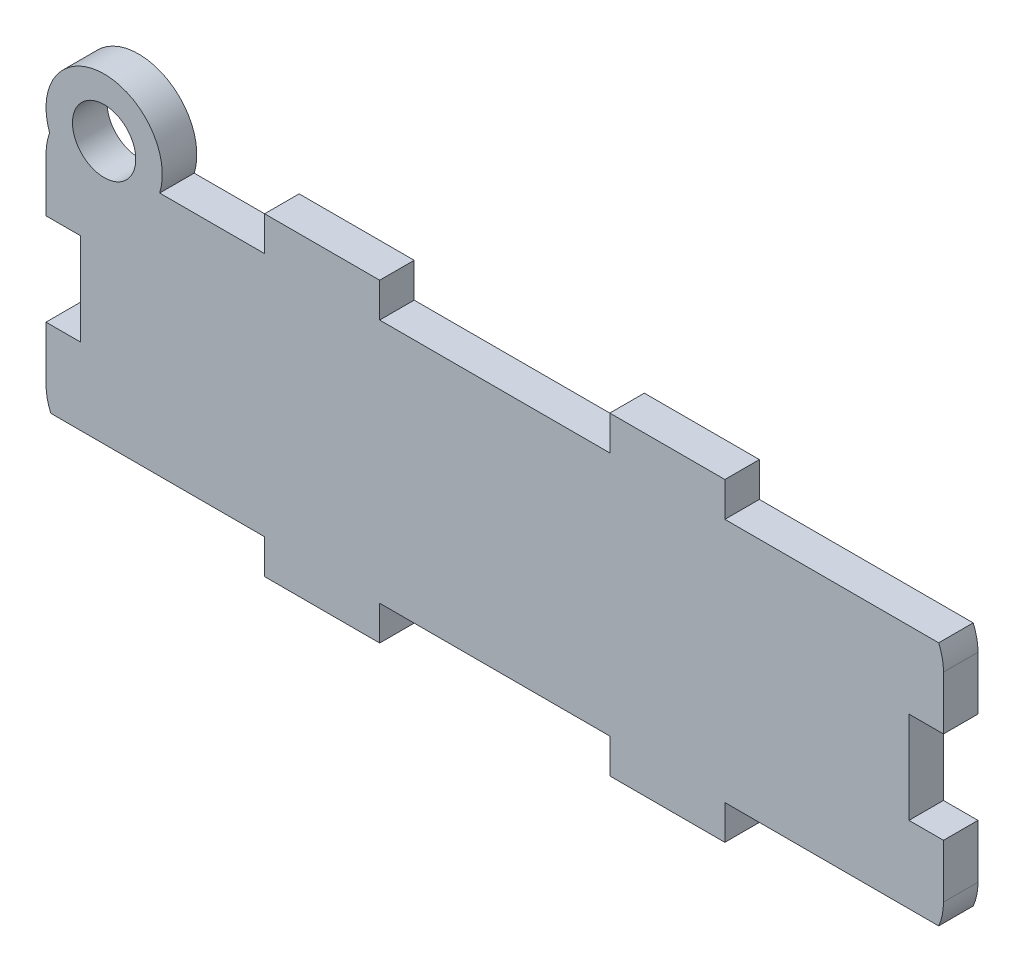
ISO-10303-21;
HEADER;
FILE_DESCRIPTION(('STEP AP214'),'2;1');
FILE_NAME('part.step','',(''),(''),'','','');
FILE_SCHEMA(('AUTOMOTIVE_DESIGN { 1 0 10303 214 1 1 1 1 }'));
ENDSEC;
DATA;
#1=APPLICATION_CONTEXT('core data for automotive mechanical design processes');
#2=APPLICATION_PROTOCOL_DEFINITION('international standard','automotive_design',2000,#1);
#3=PRODUCT_CONTEXT('',#1,'mechanical');
#4=PRODUCT('Part','Part','',(#3));
#5=PRODUCT_RELATED_PRODUCT_CATEGORY('part','',(#4));
#6=PRODUCT_DEFINITION_FORMATION('','',#4);
#7=PRODUCT_DEFINITION_CONTEXT('part definition',#1,'design');
#8=PRODUCT_DEFINITION('design','',#6,#7);
#9=PRODUCT_DEFINITION_SHAPE('','',#8);
#10=(LENGTH_UNIT() NAMED_UNIT(*) SI_UNIT(.MILLI.,.METRE.));
#11=(NAMED_UNIT(*) PLANE_ANGLE_UNIT() SI_UNIT($,.RADIAN.));
#12=(NAMED_UNIT(*) SI_UNIT($,.STERADIAN.) SOLID_ANGLE_UNIT());
#13=UNCERTAINTY_MEASURE_WITH_UNIT(LENGTH_MEASURE(1.E-05),#10,'distance_accuracy_value','');
#14=(GEOMETRIC_REPRESENTATION_CONTEXT(3) GLOBAL_UNCERTAINTY_ASSIGNED_CONTEXT((#13)) GLOBAL_UNIT_ASSIGNED_CONTEXT((#10,
#11,#12)) REPRESENTATION_CONTEXT('',''));
#15=CARTESIAN_POINT('',(0.,0.,0.));
#16=DIRECTION('',(0.,0.,1.));
#17=DIRECTION('',(1.,0.,0.));
#18=AXIS2_PLACEMENT_3D('',#15,#16,#17);
#19=CARTESIAN_POINT('',(-26.,2.00000000000004,3.));
#20=DIRECTION('',(1.,0.,0.));
#21=DIRECTION('',(0.,0.,-1.));
#22=AXIS2_PLACEMENT_3D('',#19,#20,#21);
#23=PLANE('',#22);
#24=DIRECTION('',(0.,-1.,0.));
#25=VECTOR('',#24,1.);
#26=CARTESIAN_POINT('',(-26.,2.00000000000004,3.));
#27=LINE('',#26,#25);
#28=CARTESIAN_POINT('',(-26.,6.65592079454648,3.));
#29=VERTEX_POINT('',#28);
#30=CARTESIAN_POINT('',(-26.,2.,3.));
#31=VERTEX_POINT('',#30);
#32=EDGE_CURVE('E272',#29,#31,#27,.T.);
#33=ORIENTED_EDGE('',*,*,#32,.F.);
#34=DIRECTION('',(0.,0.,-1.));
#35=VECTOR('',#34,1.);
#36=CARTESIAN_POINT('',(-26.,6.65592079454648,3.));
#37=LINE('',#36,#35);
#38=CARTESIAN_POINT('',(-26.,6.65592079454648,0.));
#39=VERTEX_POINT('',#38);
#40=EDGE_CURVE('E531',#29,#39,#37,.T.);
#41=ORIENTED_EDGE('',*,*,#40,.T.);
#42=DIRECTION('',(0.,-1.,0.));
#43=VECTOR('',#42,1.);
#44=CARTESIAN_POINT('',(-26.,2.00000000000004,0.));
#45=LINE('',#44,#43);
#46=CARTESIAN_POINT('',(-26.,2.,0.));
#47=VERTEX_POINT('',#46);
#48=EDGE_CURVE('E327',#39,#47,#45,.T.);
#49=ORIENTED_EDGE('',*,*,#48,.T.);
#50=DIRECTION('',(0.,0.,-1.));
#51=VECTOR('',#50,1.);
#52=CARTESIAN_POINT('',(-26.,2.,3.));
#53=LINE('',#52,#51);
#54=EDGE_CURVE('E406',#31,#47,#53,.T.);
#55=ORIENTED_EDGE('',*,*,#54,.F.);
#56=EDGE_LOOP('',(#33,#41,#49,#55));
#57=FACE_BOUND('',#56,.T.);
#58=ADVANCED_FACE('F32',(#57),#23,.F.);
#59=CARTESIAN_POINT('',(52.,2.00000000000004,3.));
#60=DIRECTION('',(-1.,0.,0.));
#61=DIRECTION('',(0.,0.,1.));
#62=AXIS2_PLACEMENT_3D('',#59,#60,#61);
#63=PLANE('',#62);
#64=DIRECTION('',(0.,1.,0.));
#65=VECTOR('',#64,1.);
#66=CARTESIAN_POINT('',(52.,2.00000000000004,3.));
#67=LINE('',#66,#65);
#68=CARTESIAN_POINT('',(52.,14.6559207945465,3.));
#69=VERTEX_POINT('',#68);
#70=CARTESIAN_POINT('',(52.,19.311841589093,3.));
#71=VERTEX_POINT('',#70);
#72=EDGE_CURVE('E298',#69,#71,#67,.T.);
#73=ORIENTED_EDGE('',*,*,#72,.F.);
#74=DIRECTION('',(0.,0.,-1.));
#75=VECTOR('',#74,1.);
#76=CARTESIAN_POINT('',(52.,14.6559207945465,3.));
#77=LINE('',#76,#75);
#78=CARTESIAN_POINT('',(52.,14.6559207945465,0.));
#79=VERTEX_POINT('',#78);
#80=EDGE_CURVE('E511',#69,#79,#77,.T.);
#81=ORIENTED_EDGE('',*,*,#80,.T.);
#82=DIRECTION('',(0.,1.,0.));
#83=VECTOR('',#82,1.);
#84=CARTESIAN_POINT('',(52.,2.00000000000004,0.));
#85=LINE('',#84,#83);
#86=CARTESIAN_POINT('',(52.,19.311841589093,0.));
#87=VERTEX_POINT('',#86);
#88=EDGE_CURVE('E351',#79,#87,#85,.T.);
#89=ORIENTED_EDGE('',*,*,#88,.T.);
#90=DIRECTION('',(0.,0.,-1.));
#91=VECTOR('',#90,1.);
#92=CARTESIAN_POINT('',(52.,19.311841589093,3.));
#93=LINE('',#92,#91);
#94=EDGE_CURVE('E370',#71,#87,#93,.T.);
#95=ORIENTED_EDGE('',*,*,#94,.F.);
#96=EDGE_LOOP('',(#73,#81,#89,#95));
#97=FACE_BOUND('',#96,.T.);
#98=ADVANCED_FACE('F510',(#97),#63,.F.);
#99=CARTESIAN_POINT('',(23.,24.311841589093,3.));
#100=DIRECTION('',(0.,-1.,0.));
#101=DIRECTION('',(0.,0.,-1.));
#102=AXIS2_PLACEMENT_3D('',#99,#100,#101);
#103=PLANE('',#102);
#104=DIRECTION('',(-1.,0.,0.));
#105=VECTOR('',#104,1.);
#106=CARTESIAN_POINT('',(23.,24.311841589093,0.));
#107=LINE('',#106,#105);
#108=CARTESIAN_POINT('',(33.,24.311841589093,0.));
#109=VERTEX_POINT('',#108);
#110=CARTESIAN_POINT('',(23.,24.311841589093,0.));
#111=VERTEX_POINT('',#110);
#112=EDGE_CURVE('E309',#109,#111,#107,.T.);
#113=ORIENTED_EDGE('',*,*,#112,.T.);
#114=DIRECTION('',(0.,0.,-1.));
#115=VECTOR('',#114,1.);
#116=CARTESIAN_POINT('',(23.,24.311841589093,3.));
#117=LINE('',#116,#115);
#118=CARTESIAN_POINT('',(23.,24.311841589093,3.));
#119=VERTEX_POINT('',#118);
#120=EDGE_CURVE('E11',#119,#111,#117,.T.);
#121=ORIENTED_EDGE('',*,*,#120,.F.);
#122=DIRECTION('',(-1.,0.,0.));
#123=VECTOR('',#122,1.);
#124=CARTESIAN_POINT('',(23.,24.311841589093,3.));
#125=LINE('',#124,#123);
#126=CARTESIAN_POINT('',(33.,24.311841589093,3.));
#127=VERTEX_POINT('',#126);
#128=EDGE_CURVE('E361',#127,#119,#125,.T.);
#129=ORIENTED_EDGE('',*,*,#128,.F.);
#130=DIRECTION('',(0.,0.,-1.));
#131=VECTOR('',#130,1.);
#132=CARTESIAN_POINT('',(33.,24.311841589093,3.));
#133=LINE('',#132,#131);
#134=EDGE_CURVE('E308',#127,#109,#133,.T.);
#135=ORIENTED_EDGE('',*,*,#134,.T.);
#136=EDGE_LOOP('',(#113,#121,#129,#135));
#137=FACE_BOUND('',#136,.T.);
#138=ADVANCED_FACE('F34',(#137),#103,.F.);
#139=CARTESIAN_POINT('',(23.,24.311841589093,3.));
#140=DIRECTION('',(1.,0.,0.));
#141=DIRECTION('',(0.,0.,-1.));
#142=AXIS2_PLACEMENT_3D('',#139,#140,#141);
#143=PLANE('',#142);
#144=DIRECTION('',(0.,-1.,0.));
#145=VECTOR('',#144,1.);
#146=CARTESIAN_POINT('',(23.,24.311841589093,0.));
#147=LINE('',#146,#145);
#148=CARTESIAN_POINT('',(23.,21.311841589093,0.));
#149=VERTEX_POINT('',#148);
#150=EDGE_CURVE('E312',#111,#149,#147,.T.);
#151=ORIENTED_EDGE('',*,*,#150,.T.);
#152=DIRECTION('',(0.,0.,-1.));
#153=VECTOR('',#152,1.);
#154=CARTESIAN_POINT('',(23.,21.311841589093,3.));
#155=LINE('',#154,#153);
#156=CARTESIAN_POINT('',(23.,21.311841589093,3.));
#157=VERTEX_POINT('',#156);
#158=EDGE_CURVE('E40',#157,#149,#155,.T.);
#159=ORIENTED_EDGE('',*,*,#158,.F.);
#160=DIRECTION('',(0.,-1.,0.));
#161=VECTOR('',#160,1.);
#162=CARTESIAN_POINT('',(23.,24.311841589093,3.));
#163=LINE('',#162,#161);
#164=EDGE_CURVE('E482',#119,#157,#163,.T.);
#165=ORIENTED_EDGE('',*,*,#164,.F.);
#166=ORIENTED_EDGE('',*,*,#120,.T.);
#167=EDGE_LOOP('',(#151,#159,#165,#166));
#168=FACE_BOUND('',#167,.T.);
#169=ADVANCED_FACE('F485',(#168),#143,.F.);
#170=CARTESIAN_POINT('',(3.00000000000001,21.311841589093,3.));
#171=DIRECTION('',(0.,-1.,0.));
#172=DIRECTION('',(0.,0.,-1.));
#173=AXIS2_PLACEMENT_3D('',#170,#171,#172);
#174=PLANE('',#173);
#175=DIRECTION('',(-1.,0.,0.));
#176=VECTOR('',#175,1.);
#177=CARTESIAN_POINT('',(3.00000000000001,21.311841589093,0.));
#178=LINE('',#177,#176);
#179=CARTESIAN_POINT('',(3.00000000000001,21.311841589093,0.));
#180=VERTEX_POINT('',#179);
#181=EDGE_CURVE('E315',#149,#180,#178,.T.);
#182=ORIENTED_EDGE('',*,*,#181,.T.);
#183=DIRECTION('',(0.,0.,-1.));
#184=VECTOR('',#183,1.);
#185=CARTESIAN_POINT('',(3.00000000000001,21.311841589093,3.));
#186=LINE('',#185,#184);
#187=CARTESIAN_POINT('',(3.00000000000001,21.311841589093,3.));
#188=VERTEX_POINT('',#187);
#189=EDGE_CURVE('E420',#188,#180,#186,.T.);
#190=ORIENTED_EDGE('',*,*,#189,.F.);
#191=DIRECTION('',(-1.,0.,0.));
#192=VECTOR('',#191,1.);
#193=CARTESIAN_POINT('',(3.00000000000001,21.311841589093,3.));
#194=LINE('',#193,#192);
#195=EDGE_CURVE('E429',#157,#188,#194,.T.);
#196=ORIENTED_EDGE('',*,*,#195,.F.);
#197=ORIENTED_EDGE('',*,*,#158,.T.);
#198=EDGE_LOOP('',(#182,#190,#196,#197));
#199=FACE_BOUND('',#198,.T.);
#200=ADVANCED_FACE('F427',(#199),#174,.F.);
#201=CARTESIAN_POINT('',(3.00000000000001,24.311841589093,3.));
#202=DIRECTION('',(-1.,0.,0.));
#203=DIRECTION('',(0.,0.,1.));
#204=AXIS2_PLACEMENT_3D('',#201,#202,#203);
#205=PLANE('',#204);
#206=DIRECTION('',(0.,1.,0.));
#207=VECTOR('',#206,1.);
#208=CARTESIAN_POINT('',(3.00000000000001,24.311841589093,0.));
#209=LINE('',#208,#207);
#210=CARTESIAN_POINT('',(3.00000000000001,24.311841589093,0.));
#211=VERTEX_POINT('',#210);
#212=EDGE_CURVE('E317',#180,#211,#209,.T.);
#213=ORIENTED_EDGE('',*,*,#212,.T.);
#214=DIRECTION('',(0.,0.,-1.));
#215=VECTOR('',#214,1.);
#216=CARTESIAN_POINT('',(3.00000000000001,24.311841589093,3.));
#217=LINE('',#216,#215);
#218=CARTESIAN_POINT('',(3.00000000000001,24.311841589093,3.));
#219=VERTEX_POINT('',#218);
#220=EDGE_CURVE('E417',#219,#211,#217,.T.);
#221=ORIENTED_EDGE('',*,*,#220,.F.);
#222=DIRECTION('',(0.,1.,0.));
#223=VECTOR('',#222,1.);
#224=CARTESIAN_POINT('',(3.00000000000001,24.311841589093,3.));
#225=LINE('',#224,#223);
#226=EDGE_CURVE('E450',#188,#219,#225,.T.);
#227=ORIENTED_EDGE('',*,*,#226,.F.);
#228=ORIENTED_EDGE('',*,*,#189,.T.);
#229=EDGE_LOOP('',(#213,#221,#227,#228));
#230=FACE_BOUND('',#229,.T.);
#231=ADVANCED_FACE('F441',(#230),#205,.F.);
#232=CARTESIAN_POINT('',(-6.99999999999999,24.311841589093,3.));
#233=DIRECTION('',(0.,-1.,0.));
#234=DIRECTION('',(0.,0.,-1.));
#235=AXIS2_PLACEMENT_3D('',#232,#233,#234);
#236=PLANE('',#235);
#237=DIRECTION('',(-1.,0.,0.));
#238=VECTOR('',#237,1.);
#239=CARTESIAN_POINT('',(-6.99999999999999,24.311841589093,0.));
#240=LINE('',#239,#238);
#241=CARTESIAN_POINT('',(-6.99999999999999,24.311841589093,0.));
#242=VERTEX_POINT('',#241);
#243=EDGE_CURVE('E319',#211,#242,#240,.T.);
#244=ORIENTED_EDGE('',*,*,#243,.T.);
#245=DIRECTION('',(0.,0.,-1.));
#246=VECTOR('',#245,1.);
#247=CARTESIAN_POINT('',(-6.99999999999999,24.311841589093,3.));
#248=LINE('',#247,#246);
#249=CARTESIAN_POINT('',(-6.99999999999999,24.311841589093,3.));
#250=VERTEX_POINT('',#249);
#251=EDGE_CURVE('E414',#250,#242,#248,.T.);
#252=ORIENTED_EDGE('',*,*,#251,.F.);
#253=DIRECTION('',(-1.,0.,0.));
#254=VECTOR('',#253,1.);
#255=CARTESIAN_POINT('',(-6.99999999999999,24.311841589093,3.));
#256=LINE('',#255,#254);
#257=EDGE_CURVE('E447',#219,#250,#256,.T.);
#258=ORIENTED_EDGE('',*,*,#257,.F.);
#259=ORIENTED_EDGE('',*,*,#220,.T.);
#260=EDGE_LOOP('',(#244,#252,#258,#259));
#261=FACE_BOUND('',#260,.T.);
#262=ADVANCED_FACE('F445',(#261),#236,.F.);
#263=CARTESIAN_POINT('',(-6.99999999999999,21.311841589093,3.));
#264=DIRECTION('',(1.,0.,0.));
#265=DIRECTION('',(0.,0.,-1.));
#266=AXIS2_PLACEMENT_3D('',#263,#264,#265);
#267=PLANE('',#266);
#268=DIRECTION('',(0.,-1.,0.));
#269=VECTOR('',#268,1.);
#270=CARTESIAN_POINT('',(-6.99999999999999,21.311841589093,0.));
#271=LINE('',#270,#269);
#272=CARTESIAN_POINT('',(-6.99999999999999,21.311841589093,0.));
#273=VERTEX_POINT('',#272);
#274=EDGE_CURVE('E321',#242,#273,#271,.T.);
#275=ORIENTED_EDGE('',*,*,#274,.T.);
#276=DIRECTION('',(0.,0.,-1.));
#277=VECTOR('',#276,1.);
#278=CARTESIAN_POINT('',(-6.99999999999999,21.311841589093,3.));
#279=LINE('',#278,#277);
#280=CARTESIAN_POINT('',(-6.99999999999999,21.311841589093,3.));
#281=VERTEX_POINT('',#280);
#282=EDGE_CURVE('E411',#281,#273,#279,.T.);
#283=ORIENTED_EDGE('',*,*,#282,.F.);
#284=DIRECTION('',(0.,-1.,0.));
#285=VECTOR('',#284,1.);
#286=CARTESIAN_POINT('',(-6.99999999999999,21.311841589093,3.));
#287=LINE('',#286,#285);
#288=EDGE_CURVE('E449',#250,#281,#287,.T.);
#289=ORIENTED_EDGE('',*,*,#288,.F.);
#290=ORIENTED_EDGE('',*,*,#251,.T.);
#291=EDGE_LOOP('',(#275,#283,#289,#290));
#292=FACE_BOUND('',#291,.T.);
#293=ADVANCED_FACE('F659',(#292),#267,.F.);
#294=CARTESIAN_POINT('',(-6.99999999999999,21.311841589093,3.));
#295=DIRECTION('',(0.,-1.,0.));
#296=DIRECTION('',(0.,0.,-1.));
#297=AXIS2_PLACEMENT_3D('',#294,#295,#296);
#298=PLANE('',#297);
#299=DIRECTION('',(-1.,0.,0.));
#300=VECTOR('',#299,1.);
#301=CARTESIAN_POINT('',(-6.99999999999999,21.311841589093,0.));
#302=LINE('',#301,#300);
#303=CARTESIAN_POINT('',(-16.119925350834,21.311841589093,0.));
#304=VERTEX_POINT('',#303);
#305=EDGE_CURVE('E323',#273,#304,#302,.T.);
#306=ORIENTED_EDGE('',*,*,#305,.T.);
#307=DIRECTION('',(0.,0.,-1.));
#308=VECTOR('',#307,1.);
#309=CARTESIAN_POINT('',(-16.119925350834,21.311841589093,3.));
#310=LINE('',#309,#308);
#311=CARTESIAN_POINT('',(-16.119925350834,21.311841589093,3.));
#312=VERTEX_POINT('',#311);
#313=EDGE_CURVE('E313',#304,#312,#310,.F.);
#314=ORIENTED_EDGE('',*,*,#313,.T.);
#315=DIRECTION('',(-1.,0.,0.));
#316=VECTOR('',#315,1.);
#317=CARTESIAN_POINT('',(-6.99999999999999,21.311841589093,3.));
#318=LINE('',#317,#316);
#319=EDGE_CURVE('E452',#281,#312,#318,.T.);
#320=ORIENTED_EDGE('',*,*,#319,.F.);
#321=ORIENTED_EDGE('',*,*,#282,.T.);
#322=EDGE_LOOP('',(#306,#314,#320,#321));
#323=FACE_BOUND('',#322,.T.);
#324=ADVANCED_FACE('F654',(#323),#298,.F.);
#325=CARTESIAN_POINT('',(-21.,19.311841589093,3.));
#326=DIRECTION('',(0.,0.,-1.));
#327=DIRECTION('',(-1.,0.,0.));
#328=AXIS2_PLACEMENT_3D('',#325,#326,#327);
#329=CYLINDRICAL_SURFACE('',#328,5.);
#330=CARTESIAN_POINT('',(-21.,19.311841589093,3.));
#331=DIRECTION('',(0.,0.,1.));
#332=DIRECTION('',(-1.,0.,0.));
#333=AXIS2_PLACEMENT_3D('',#330,#331,#332);
#334=CIRCLE('',#333,5.);
#335=CARTESIAN_POINT('',(-25.6855550398169,21.0569988796678,3.));
#336=VERTEX_POINT('',#335);
#337=CARTESIAN_POINT('',(-26.,19.311841589093,3.));
#338=VERTEX_POINT('',#337);
#339=EDGE_CURVE('E269',#336,#338,#334,.T.);
#340=ORIENTED_EDGE('',*,*,#339,.F.);
#341=DIRECTION('',(0.,0.,-1.));
#342=VECTOR('',#341,1.);
#343=CARTESIAN_POINT('',(-25.6855550398169,21.0569988796678,1.5));
#344=LINE('',#343,#342);
#345=CARTESIAN_POINT('',(-25.6855550398169,21.0569988796678,0.));
#346=VERTEX_POINT('',#345);
#347=EDGE_CURVE('E469',#336,#346,#344,.T.);
#348=ORIENTED_EDGE('',*,*,#347,.T.);
#349=CARTESIAN_POINT('',(-21.,19.311841589093,0.));
#350=DIRECTION('',(0.,0.,1.));
#351=DIRECTION('',(-1.,0.,0.));
#352=AXIS2_PLACEMENT_3D('',#349,#350,#351);
#353=CIRCLE('',#352,5.);
#354=CARTESIAN_POINT('',(-26.,19.311841589093,0.));
#355=VERTEX_POINT('',#354);
#356=EDGE_CURVE('E325',#346,#355,#353,.T.);
#357=ORIENTED_EDGE('',*,*,#356,.T.);
#358=DIRECTION('',(0.,0.,-1.));
#359=VECTOR('',#358,1.);
#360=CARTESIAN_POINT('',(-26.,19.311841589093,3.));
#361=LINE('',#360,#359);
#362=EDGE_CURVE('E409',#338,#355,#361,.T.);
#363=ORIENTED_EDGE('',*,*,#362,.F.);
#364=EDGE_LOOP('',(#340,#348,#357,#363));
#365=FACE_BOUND('',#364,.T.);
#366=ADVANCED_FACE('F648',(#365),#329,.T.);
#367=CARTESIAN_POINT('',(-26.,14.6559207945465,0.));
#368=VERTEX_POINT('',#367);
#369=EDGE_CURVE('E264',#355,#368,#45,.T.);
#370=ORIENTED_EDGE('',*,*,#369,.T.);
#371=DIRECTION('',(0.,0.,-1.));
#372=VECTOR('',#371,1.);
#373=CARTESIAN_POINT('',(-26.,14.6559207945465,3.));
#374=LINE('',#373,#372);
#375=CARTESIAN_POINT('',(-26.,14.6559207945465,3.));
#376=VERTEX_POINT('',#375);
#377=EDGE_CURVE('E47',#376,#368,#374,.T.);
#378=ORIENTED_EDGE('',*,*,#377,.F.);
#379=EDGE_CURVE('E262',#338,#376,#27,.T.);
#380=ORIENTED_EDGE('',*,*,#379,.F.);
#381=ORIENTED_EDGE('',*,*,#362,.T.);
#382=EDGE_LOOP('',(#370,#378,#380,#381));
#383=FACE_BOUND('',#382,.T.);
#384=ADVANCED_FACE('F260',(#383),#23,.F.);
#385=CARTESIAN_POINT('',(-21.,2.,3.));
#386=DIRECTION('',(0.,0.,-1.));
#387=DIRECTION('',(-1.,0.,0.));
#388=AXIS2_PLACEMENT_3D('',#385,#386,#387);
#389=CYLINDRICAL_SURFACE('',#388,5.);
#390=CARTESIAN_POINT('',(-21.,2.,0.));
#391=DIRECTION('',(0.,0.,1.));
#392=DIRECTION('',(-1.,0.,0.));
#393=AXIS2_PLACEMENT_3D('',#390,#391,#392);
#394=CIRCLE('',#393,5.);
#395=CARTESIAN_POINT('',(-25.5825756949558,0.,0.));
#396=VERTEX_POINT('',#395);
#397=EDGE_CURVE('E329',#47,#396,#394,.T.);
#398=ORIENTED_EDGE('',*,*,#397,.T.);
#399=DIRECTION('',(0.,0.,-1.));
#400=VECTOR('',#399,1.);
#401=CARTESIAN_POINT('',(-25.5825756949558,0.,3.));
#402=LINE('',#401,#400);
#403=CARTESIAN_POINT('',(-25.5825756949558,0.,3.));
#404=VERTEX_POINT('',#403);
#405=EDGE_CURVE('E403',#404,#396,#402,.T.);
#406=ORIENTED_EDGE('',*,*,#405,.F.);
#407=CARTESIAN_POINT('',(-21.,2.,3.));
#408=DIRECTION('',(0.,0.,1.));
#409=DIRECTION('',(-1.,0.,0.));
#410=AXIS2_PLACEMENT_3D('',#407,#408,#409);
#411=CIRCLE('',#410,5.);
#412=EDGE_CURVE('E271',#31,#404,#411,.T.);
#413=ORIENTED_EDGE('',*,*,#412,.F.);
#414=ORIENTED_EDGE('',*,*,#54,.T.);
#415=EDGE_LOOP('',(#398,#406,#413,#414));
#416=FACE_BOUND('',#415,.T.);
#417=ADVANCED_FACE('F618',(#416),#389,.T.);
#418=CARTESIAN_POINT('',(-6.99999999999999,0.,3.));
#419=DIRECTION('',(0.,1.,0.));
#420=DIRECTION('',(0.,0.,1.));
#421=AXIS2_PLACEMENT_3D('',#418,#419,#420);
#422=PLANE('',#421);
#423=DIRECTION('',(1.,0.,0.));
#424=VECTOR('',#423,1.);
#425=CARTESIAN_POINT('',(-6.99999999999999,0.,0.));
#426=LINE('',#425,#424);
#427=CARTESIAN_POINT('',(-6.99999999999999,0.,0.));
#428=VERTEX_POINT('',#427);
#429=EDGE_CURVE('E331',#396,#428,#426,.T.);
#430=ORIENTED_EDGE('',*,*,#429,.T.);
#431=DIRECTION('',(0.,0.,-1.));
#432=VECTOR('',#431,1.);
#433=CARTESIAN_POINT('',(-6.99999999999999,0.,3.));
#434=LINE('',#433,#432);
#435=CARTESIAN_POINT('',(-6.99999999999999,0.,3.));
#436=VERTEX_POINT('',#435);
#437=EDGE_CURVE('E400',#436,#428,#434,.T.);
#438=ORIENTED_EDGE('',*,*,#437,.F.);
#439=DIRECTION('',(1.,0.,0.));
#440=VECTOR('',#439,1.);
#441=CARTESIAN_POINT('',(-6.99999999999999,0.,3.));
#442=LINE('',#441,#440);
#443=EDGE_CURVE('E274',#404,#436,#442,.T.);
#444=ORIENTED_EDGE('',*,*,#443,.F.);
#445=ORIENTED_EDGE('',*,*,#405,.T.);
#446=EDGE_LOOP('',(#430,#438,#444,#445));
#447=FACE_BOUND('',#446,.T.);
#448=ADVANCED_FACE('F613',(#447),#422,.F.);
#449=CARTESIAN_POINT('',(-6.99999999999999,0.,3.));
#450=DIRECTION('',(1.,0.,0.));
#451=DIRECTION('',(0.,0.,-1.));
#452=AXIS2_PLACEMENT_3D('',#449,#450,#451);
#453=PLANE('',#452);
#454=DIRECTION('',(0.,-1.,0.));
#455=VECTOR('',#454,1.);
#456=CARTESIAN_POINT('',(-6.99999999999999,0.,0.));
#457=LINE('',#456,#455);
#458=CARTESIAN_POINT('',(-6.99999999999999,-3.,0.));
#459=VERTEX_POINT('',#458);
#460=EDGE_CURVE('E333',#428,#459,#457,.T.);
#461=ORIENTED_EDGE('',*,*,#460,.T.);
#462=DIRECTION('',(0.,0.,-1.));
#463=VECTOR('',#462,1.);
#464=CARTESIAN_POINT('',(-6.99999999999999,-3.,3.));
#465=LINE('',#464,#463);
#466=CARTESIAN_POINT('',(-6.99999999999999,-3.,3.));
#467=VERTEX_POINT('',#466);
#468=EDGE_CURVE('E397',#467,#459,#465,.T.);
#469=ORIENTED_EDGE('',*,*,#468,.F.);
#470=DIRECTION('',(0.,-1.,0.));
#471=VECTOR('',#470,1.);
#472=CARTESIAN_POINT('',(-6.99999999999999,0.,3.));
#473=LINE('',#472,#471);
#474=EDGE_CURVE('E280',#436,#467,#473,.T.);
#475=ORIENTED_EDGE('',*,*,#474,.F.);
#476=ORIENTED_EDGE('',*,*,#437,.T.);
#477=EDGE_LOOP('',(#461,#469,#475,#476));
#478=FACE_BOUND('',#477,.T.);
#479=ADVANCED_FACE('F608',(#478),#453,.F.);
#480=CARTESIAN_POINT('',(-6.99999999999999,-3.,3.));
#481=DIRECTION('',(0.,1.,0.));
#482=DIRECTION('',(0.,0.,1.));
#483=AXIS2_PLACEMENT_3D('',#480,#481,#482);
#484=PLANE('',#483);
#485=DIRECTION('',(1.,0.,0.));
#486=VECTOR('',#485,1.);
#487=CARTESIAN_POINT('',(-6.99999999999999,-3.,0.));
#488=LINE('',#487,#486);
#489=CARTESIAN_POINT('',(3.00000000000001,-3.,0.));
#490=VERTEX_POINT('',#489);
#491=EDGE_CURVE('E335',#459,#490,#488,.T.);
#492=ORIENTED_EDGE('',*,*,#491,.T.);
#493=DIRECTION('',(0.,0.,-1.));
#494=VECTOR('',#493,1.);
#495=CARTESIAN_POINT('',(3.00000000000001,-3.,3.));
#496=LINE('',#495,#494);
#497=CARTESIAN_POINT('',(3.00000000000001,-3.,3.));
#498=VERTEX_POINT('',#497);
#499=EDGE_CURVE('E394',#498,#490,#496,.T.);
#500=ORIENTED_EDGE('',*,*,#499,.F.);
#501=DIRECTION('',(1.,0.,0.));
#502=VECTOR('',#501,1.);
#503=CARTESIAN_POINT('',(-6.99999999999999,-3.,3.));
#504=LINE('',#503,#502);
#505=EDGE_CURVE('E282',#467,#498,#504,.T.);
#506=ORIENTED_EDGE('',*,*,#505,.F.);
#507=ORIENTED_EDGE('',*,*,#468,.T.);
#508=EDGE_LOOP('',(#492,#500,#506,#507));
#509=FACE_BOUND('',#508,.T.);
#510=ADVANCED_FACE('F604',(#509),#484,.F.);
#511=CARTESIAN_POINT('',(3.00000000000001,-3.,3.));
#512=DIRECTION('',(-1.,0.,0.));
#513=DIRECTION('',(0.,0.,1.));
#514=AXIS2_PLACEMENT_3D('',#511,#512,#513);
#515=PLANE('',#514);
#516=DIRECTION('',(0.,1.,0.));
#517=VECTOR('',#516,1.);
#518=CARTESIAN_POINT('',(3.00000000000001,-3.,0.));
#519=LINE('',#518,#517);
#520=CARTESIAN_POINT('',(3.00000000000001,0.,0.));
#521=VERTEX_POINT('',#520);
#522=EDGE_CURVE('E337',#490,#521,#519,.T.);
#523=ORIENTED_EDGE('',*,*,#522,.T.);
#524=DIRECTION('',(0.,0.,-1.));
#525=VECTOR('',#524,1.);
#526=CARTESIAN_POINT('',(3.00000000000001,0.,3.));
#527=LINE('',#526,#525);
#528=CARTESIAN_POINT('',(3.00000000000001,0.,3.));
#529=VERTEX_POINT('',#528);
#530=EDGE_CURVE('E391',#529,#521,#527,.T.);
#531=ORIENTED_EDGE('',*,*,#530,.F.);
#532=DIRECTION('',(0.,1.,0.));
#533=VECTOR('',#532,1.);
#534=CARTESIAN_POINT('',(3.00000000000001,-3.,3.));
#535=LINE('',#534,#533);
#536=EDGE_CURVE('E284',#498,#529,#535,.T.);
#537=ORIENTED_EDGE('',*,*,#536,.F.);
#538=ORIENTED_EDGE('',*,*,#499,.T.);
#539=EDGE_LOOP('',(#523,#531,#537,#538));
#540=FACE_BOUND('',#539,.T.);
#541=ADVANCED_FACE('F599',(#540),#515,.F.);
#542=CARTESIAN_POINT('',(3.00000000000001,0.,3.));
#543=DIRECTION('',(0.,1.,0.));
#544=DIRECTION('',(0.,0.,1.));
#545=AXIS2_PLACEMENT_3D('',#542,#543,#544);
#546=PLANE('',#545);
#547=DIRECTION('',(1.,0.,0.));
#548=VECTOR('',#547,1.);
#549=CARTESIAN_POINT('',(3.00000000000001,0.,0.));
#550=LINE('',#549,#548);
#551=CARTESIAN_POINT('',(23.,0.,0.));
#552=VERTEX_POINT('',#551);
#553=EDGE_CURVE('E339',#521,#552,#550,.T.);
#554=ORIENTED_EDGE('',*,*,#553,.T.);
#555=DIRECTION('',(0.,0.,-1.));
#556=VECTOR('',#555,1.);
#557=CARTESIAN_POINT('',(23.,0.,3.));
#558=LINE('',#557,#556);
#559=CARTESIAN_POINT('',(23.,0.,3.));
#560=VERTEX_POINT('',#559);
#561=EDGE_CURVE('E388',#560,#552,#558,.T.);
#562=ORIENTED_EDGE('',*,*,#561,.F.);
#563=DIRECTION('',(1.,0.,0.));
#564=VECTOR('',#563,1.);
#565=CARTESIAN_POINT('',(3.00000000000001,0.,3.));
#566=LINE('',#565,#564);
#567=EDGE_CURVE('E286',#529,#560,#566,.T.);
#568=ORIENTED_EDGE('',*,*,#567,.F.);
#569=ORIENTED_EDGE('',*,*,#530,.T.);
#570=EDGE_LOOP('',(#554,#562,#568,#569));
#571=FACE_BOUND('',#570,.T.);
#572=ADVANCED_FACE('F593',(#571),#546,.F.);
#573=CARTESIAN_POINT('',(23.,-3.,3.));
#574=DIRECTION('',(1.,0.,0.));
#575=DIRECTION('',(0.,0.,-1.));
#576=AXIS2_PLACEMENT_3D('',#573,#574,#575);
#577=PLANE('',#576);
#578=DIRECTION('',(0.,-1.,0.));
#579=VECTOR('',#578,1.);
#580=CARTESIAN_POINT('',(23.,-3.,0.));
#581=LINE('',#580,#579);
#582=CARTESIAN_POINT('',(23.,-3.,0.));
#583=VERTEX_POINT('',#582);
#584=EDGE_CURVE('E341',#552,#583,#581,.T.);
#585=ORIENTED_EDGE('',*,*,#584,.T.);
#586=DIRECTION('',(0.,0.,-1.));
#587=VECTOR('',#586,1.);
#588=CARTESIAN_POINT('',(23.,-3.,3.));
#589=LINE('',#588,#587);
#590=CARTESIAN_POINT('',(23.,-3.,3.));
#591=VERTEX_POINT('',#590);
#592=EDGE_CURVE('E385',#591,#583,#589,.T.);
#593=ORIENTED_EDGE('',*,*,#592,.F.);
#594=DIRECTION('',(0.,-1.,0.));
#595=VECTOR('',#594,1.);
#596=CARTESIAN_POINT('',(23.,-3.,3.));
#597=LINE('',#596,#595);
#598=EDGE_CURVE('E288',#560,#591,#597,.T.);
#599=ORIENTED_EDGE('',*,*,#598,.F.);
#600=ORIENTED_EDGE('',*,*,#561,.T.);
#601=EDGE_LOOP('',(#585,#593,#599,#600));
#602=FACE_BOUND('',#601,.T.);
#603=ADVANCED_FACE('F589',(#602),#577,.F.);
#604=CARTESIAN_POINT('',(23.,-3.,3.));
#605=DIRECTION('',(0.,1.,0.));
#606=DIRECTION('',(0.,0.,1.));
#607=AXIS2_PLACEMENT_3D('',#604,#605,#606);
#608=PLANE('',#607);
#609=DIRECTION('',(1.,0.,0.));
#610=VECTOR('',#609,1.);
#611=CARTESIAN_POINT('',(23.,-3.,0.));
#612=LINE('',#611,#610);
#613=CARTESIAN_POINT('',(33.,-3.,0.));
#614=VERTEX_POINT('',#613);
#615=EDGE_CURVE('E343',#583,#614,#612,.T.);
#616=ORIENTED_EDGE('',*,*,#615,.T.);
#617=DIRECTION('',(0.,0.,-1.));
#618=VECTOR('',#617,1.);
#619=CARTESIAN_POINT('',(33.,-3.,3.));
#620=LINE('',#619,#618);
#621=CARTESIAN_POINT('',(33.,-3.,3.));
#622=VERTEX_POINT('',#621);
#623=EDGE_CURVE('E382',#622,#614,#620,.T.);
#624=ORIENTED_EDGE('',*,*,#623,.F.);
#625=DIRECTION('',(1.,0.,0.));
#626=VECTOR('',#625,1.);
#627=CARTESIAN_POINT('',(23.,-3.,3.));
#628=LINE('',#627,#626);
#629=EDGE_CURVE('E290',#591,#622,#628,.T.);
#630=ORIENTED_EDGE('',*,*,#629,.F.);
#631=ORIENTED_EDGE('',*,*,#592,.T.);
#632=EDGE_LOOP('',(#616,#624,#630,#631));
#633=FACE_BOUND('',#632,.T.);
#634=ADVANCED_FACE('F584',(#633),#608,.F.);
#635=CARTESIAN_POINT('',(33.,-3.,3.));
#636=DIRECTION('',(-1.,1.06396373193249E-13,0.));
#637=DIRECTION('',(-1.06396373193249E-13,-1.,0.));
#638=AXIS2_PLACEMENT_3D('',#635,#636,#637);
#639=PLANE('',#638);
#640=DIRECTION('',(1.06396373193249E-13,1.,0.));
#641=VECTOR('',#640,1.);
#642=CARTESIAN_POINT('',(33.,-3.,0.));
#643=LINE('',#642,#641);
#644=CARTESIAN_POINT('',(33.0000000000003,-1.25363714742639E-13,0.));
#645=VERTEX_POINT('',#644);
#646=EDGE_CURVE('E345',#614,#645,#643,.T.);
#647=ORIENTED_EDGE('',*,*,#646,.T.);
#648=DIRECTION('',(0.,0.,-1.));
#649=VECTOR('',#648,1.);
#650=CARTESIAN_POINT('',(33.0000000000003,-1.25363714742639E-13,3.));
#651=LINE('',#650,#649);
#652=CARTESIAN_POINT('',(33.0000000000003,-1.25363714742639E-13,3.));
#653=VERTEX_POINT('',#652);
#654=EDGE_CURVE('E379',#653,#645,#651,.T.);
#655=ORIENTED_EDGE('',*,*,#654,.F.);
#656=DIRECTION('',(1.06396373193249E-13,1.,0.));
#657=VECTOR('',#656,1.);
#658=CARTESIAN_POINT('',(33.,-3.,3.));
#659=LINE('',#658,#657);
#660=EDGE_CURVE('E292',#622,#653,#659,.T.);
#661=ORIENTED_EDGE('',*,*,#660,.F.);
#662=ORIENTED_EDGE('',*,*,#623,.T.);
#663=EDGE_LOOP('',(#647,#655,#661,#662));
#664=FACE_BOUND('',#663,.T.);
#665=ADVANCED_FACE('F578',(#664),#639,.F.);
#666=CARTESIAN_POINT('',(33.0000000000003,-1.25363714742639E-13,3.));
#667=DIRECTION('',(0.,1.,0.));
#668=DIRECTION('',(-1.,0.,0.));
#669=AXIS2_PLACEMENT_3D('',#666,#667,#668);
#670=PLANE('',#669);
#671=DIRECTION('',(1.,0.,0.));
#672=VECTOR('',#671,1.);
#673=CARTESIAN_POINT('',(33.0000000000003,-1.25363714742639E-13,0.));
#674=LINE('',#673,#672);
#675=CARTESIAN_POINT('',(51.5825756949558,0.,0.));
#676=VERTEX_POINT('',#675);
#677=EDGE_CURVE('E347',#645,#676,#674,.T.);
#678=ORIENTED_EDGE('',*,*,#677,.T.);
#679=DIRECTION('',(0.,0.,-1.));
#680=VECTOR('',#679,1.);
#681=CARTESIAN_POINT('',(51.5825756949558,0.,3.));
#682=LINE('',#681,#680);
#683=CARTESIAN_POINT('',(51.5825756949558,0.,3.));
#684=VERTEX_POINT('',#683);
#685=EDGE_CURVE('E376',#684,#676,#682,.T.);
#686=ORIENTED_EDGE('',*,*,#685,.F.);
#687=DIRECTION('',(1.,0.,0.));
#688=VECTOR('',#687,1.);
#689=CARTESIAN_POINT('',(33.0000000000003,-1.25363714742639E-13,3.));
#690=LINE('',#689,#688);
#691=EDGE_CURVE('E294',#653,#684,#690,.T.);
#692=ORIENTED_EDGE('',*,*,#691,.F.);
#693=ORIENTED_EDGE('',*,*,#654,.T.);
#694=EDGE_LOOP('',(#678,#686,#692,#693));
#695=FACE_BOUND('',#694,.T.);
#696=ADVANCED_FACE('F574',(#695),#670,.F.);
#697=CARTESIAN_POINT('',(47.,2.,3.));
#698=DIRECTION('',(0.,0.,-1.));
#699=DIRECTION('',(-1.,0.,0.));
#700=AXIS2_PLACEMENT_3D('',#697,#698,#699);
#701=CYLINDRICAL_SURFACE('',#700,5.);
#702=CARTESIAN_POINT('',(47.,2.,0.));
#703=DIRECTION('',(0.,0.,1.));
#704=DIRECTION('',(1.,0.,0.));
#705=AXIS2_PLACEMENT_3D('',#702,#703,#704);
#706=CIRCLE('',#705,5.);
#707=CARTESIAN_POINT('',(52.,2.00000000000004,0.));
#708=VERTEX_POINT('',#707);
#709=EDGE_CURVE('E349',#676,#708,#706,.T.);
#710=ORIENTED_EDGE('',*,*,#709,.T.);
#711=DIRECTION('',(0.,0.,-1.));
#712=VECTOR('',#711,1.);
#713=CARTESIAN_POINT('',(52.,2.00000000000004,3.));
#714=LINE('',#713,#712);
#715=CARTESIAN_POINT('',(52.,2.00000000000004,3.));
#716=VERTEX_POINT('',#715);
#717=EDGE_CURVE('E373',#716,#708,#714,.T.);
#718=ORIENTED_EDGE('',*,*,#717,.F.);
#719=CARTESIAN_POINT('',(47.,2.,3.));
#720=DIRECTION('',(0.,0.,1.));
#721=DIRECTION('',(1.,0.,0.));
#722=AXIS2_PLACEMENT_3D('',#719,#720,#721);
#723=CIRCLE('',#722,5.);
#724=EDGE_CURVE('E296',#684,#716,#723,.T.);
#725=ORIENTED_EDGE('',*,*,#724,.F.);
#726=ORIENTED_EDGE('',*,*,#685,.T.);
#727=EDGE_LOOP('',(#710,#718,#725,#726));
#728=FACE_BOUND('',#727,.T.);
#729=ADVANCED_FACE('F569',(#728),#701,.T.);
#730=CARTESIAN_POINT('',(52.,6.65592079454648,0.));
#731=VERTEX_POINT('',#730);
#732=EDGE_CURVE('E352',#708,#731,#85,.T.);
#733=ORIENTED_EDGE('',*,*,#732,.T.);
#734=DIRECTION('',(0.,0.,-1.));
#735=VECTOR('',#734,1.);
#736=CARTESIAN_POINT('',(52.,6.65592079454648,3.));
#737=LINE('',#736,#735);
#738=CARTESIAN_POINT('',(52.,6.65592079454648,3.));
#739=VERTEX_POINT('',#738);
#740=EDGE_CURVE('E55',#739,#731,#737,.T.);
#741=ORIENTED_EDGE('',*,*,#740,.F.);
#742=EDGE_CURVE('E299',#716,#739,#67,.T.);
#743=ORIENTED_EDGE('',*,*,#742,.F.);
#744=ORIENTED_EDGE('',*,*,#717,.T.);
#745=EDGE_LOOP('',(#733,#741,#743,#744));
#746=FACE_BOUND('',#745,.T.);
#747=ADVANCED_FACE('F562',(#746),#63,.F.);
#748=CARTESIAN_POINT('',(47.,19.311841589093,3.));
#749=DIRECTION('',(0.,0.,-1.));
#750=DIRECTION('',(-1.,0.,0.));
#751=AXIS2_PLACEMENT_3D('',#748,#749,#750);
#752=CYLINDRICAL_SURFACE('',#751,5.);
#753=CARTESIAN_POINT('',(47.,19.311841589093,0.));
#754=DIRECTION('',(0.,0.,1.));
#755=DIRECTION('',(-1.,0.,0.));
#756=AXIS2_PLACEMENT_3D('',#753,#754,#755);
#757=CIRCLE('',#756,5.);
#758=CARTESIAN_POINT('',(51.5825756949558,21.311841589093,0.));
#759=VERTEX_POINT('',#758);
#760=EDGE_CURVE('E355',#87,#759,#757,.T.);
#761=ORIENTED_EDGE('',*,*,#760,.T.);
#762=DIRECTION('',(0.,0.,-1.));
#763=VECTOR('',#762,1.);
#764=CARTESIAN_POINT('',(51.5825756949558,21.311841589093,3.));
#765=LINE('',#764,#763);
#766=CARTESIAN_POINT('',(51.5825756949558,21.311841589093,3.));
#767=VERTEX_POINT('',#766);
#768=EDGE_CURVE('E367',#767,#759,#765,.T.);
#769=ORIENTED_EDGE('',*,*,#768,.F.);
#770=CARTESIAN_POINT('',(47.,19.311841589093,3.));
#771=DIRECTION('',(0.,0.,1.));
#772=DIRECTION('',(-1.,0.,0.));
#773=AXIS2_PLACEMENT_3D('',#770,#771,#772);
#774=CIRCLE('',#773,5.);
#775=EDGE_CURVE('E302',#71,#767,#774,.T.);
#776=ORIENTED_EDGE('',*,*,#775,.F.);
#777=ORIENTED_EDGE('',*,*,#94,.T.);
#778=EDGE_LOOP('',(#761,#769,#776,#777));
#779=FACE_BOUND('',#778,.T.);
#780=ADVANCED_FACE('F501',(#779),#752,.T.);
#781=CARTESIAN_POINT('',(33.,21.311841589093,3.));
#782=DIRECTION('',(0.,-1.,0.));
#783=DIRECTION('',(0.,0.,-1.));
#784=AXIS2_PLACEMENT_3D('',#781,#782,#783);
#785=PLANE('',#784);
#786=DIRECTION('',(-1.,0.,0.));
#787=VECTOR('',#786,1.);
#788=CARTESIAN_POINT('',(33.,21.311841589093,0.));
#789=LINE('',#788,#787);
#790=CARTESIAN_POINT('',(33.,21.311841589093,0.));
#791=VERTEX_POINT('',#790);
#792=EDGE_CURVE('E357',#759,#791,#789,.T.);
#793=ORIENTED_EDGE('',*,*,#792,.T.);
#794=DIRECTION('',(0.,0.,-1.));
#795=VECTOR('',#794,1.);
#796=CARTESIAN_POINT('',(33.,21.311841589093,3.));
#797=LINE('',#796,#795);
#798=CARTESIAN_POINT('',(33.,21.311841589093,3.));
#799=VERTEX_POINT('',#798);
#800=EDGE_CURVE('E364',#799,#791,#797,.T.);
#801=ORIENTED_EDGE('',*,*,#800,.F.);
#802=DIRECTION('',(-1.,0.,0.));
#803=VECTOR('',#802,1.);
#804=CARTESIAN_POINT('',(33.,21.311841589093,3.));
#805=LINE('',#804,#803);
#806=EDGE_CURVE('E304',#767,#799,#805,.T.);
#807=ORIENTED_EDGE('',*,*,#806,.F.);
#808=ORIENTED_EDGE('',*,*,#768,.T.);
#809=EDGE_LOOP('',(#793,#801,#807,#808));
#810=FACE_BOUND('',#809,.T.);
#811=ADVANCED_FACE('F497',(#810),#785,.F.);
#812=CARTESIAN_POINT('',(33.,24.311841589093,3.));
#813=DIRECTION('',(-1.,0.,0.));
#814=DIRECTION('',(0.,0.,1.));
#815=AXIS2_PLACEMENT_3D('',#812,#813,#814);
#816=PLANE('',#815);
#817=DIRECTION('',(0.,1.,0.));
#818=VECTOR('',#817,1.);
#819=CARTESIAN_POINT('',(33.,24.311841589093,0.));
#820=LINE('',#819,#818);
#821=EDGE_CURVE('E359',#791,#109,#820,.T.);
#822=ORIENTED_EDGE('',*,*,#821,.T.);
#823=ORIENTED_EDGE('',*,*,#134,.F.);
#824=DIRECTION('',(0.,1.,0.));
#825=VECTOR('',#824,1.);
#826=CARTESIAN_POINT('',(33.,24.311841589093,3.));
#827=LINE('',#826,#825);
#828=EDGE_CURVE('E306',#799,#127,#827,.T.);
#829=ORIENTED_EDGE('',*,*,#828,.F.);
#830=ORIENTED_EDGE('',*,*,#800,.T.);
#831=EDGE_LOOP('',(#822,#823,#829,#830));
#832=FACE_BOUND('',#831,.T.);
#833=ADVANCED_FACE('F492',(#832),#816,.F.);
#834=CARTESIAN_POINT('',(47.,19.311841589093,3.));
#835=DIRECTION('',(0.,0.,-1.));
#836=DIRECTION('',(-1.,0.,0.));
#837=AXIS2_PLACEMENT_3D('',#834,#835,#836);
#838=PLANE('',#837);
#839=CARTESIAN_POINT('',(-20.9460971389765,22.811841589093,3.));
#840=DIRECTION('',(0.,0.,-1.));
#841=DIRECTION('',(-1.,0.,0.));
#842=AXIS2_PLACEMENT_3D('',#839,#840,#841);
#843=CIRCLE('',#842,2.74976983341903);
#844=CARTESIAN_POINT('',(-23.6958669723955,22.811841589093,3.));
#845=VERTEX_POINT('',#844);
#846=EDGE_CURVE('E473',#845,#845,#843,.T.);
#847=ORIENTED_EDGE('',*,*,#846,.T.);
#848=EDGE_LOOP('',(#847));
#849=FACE_BOUND('',#848,.T.);
#850=DIRECTION('',(0.,-1.,0.));
#851=VECTOR('',#850,1.);
#852=CARTESIAN_POINT('',(-23.,6.65592079454648,3.));
#853=LINE('',#852,#851);
#854=CARTESIAN_POINT('',(-23.,14.6559207945465,3.));
#855=VERTEX_POINT('',#854);
#856=CARTESIAN_POINT('',(-23.,6.65592079454648,3.));
#857=VERTEX_POINT('',#856);
#858=EDGE_CURVE('E254',#855,#857,#853,.T.);
#859=ORIENTED_EDGE('',*,*,#858,.T.);
#860=DIRECTION('',(-1.,0.,0.));
#861=VECTOR('',#860,1.);
#862=CARTESIAN_POINT('',(-26.,6.65592079454648,3.));
#863=LINE('',#862,#861);
#864=EDGE_CURVE('E265',#857,#29,#863,.T.);
#865=ORIENTED_EDGE('',*,*,#864,.T.);
#866=ORIENTED_EDGE('',*,*,#32,.T.);
#867=ORIENTED_EDGE('',*,*,#412,.T.);
#868=ORIENTED_EDGE('',*,*,#443,.T.);
#869=ORIENTED_EDGE('',*,*,#474,.T.);
#870=ORIENTED_EDGE('',*,*,#505,.T.);
#871=ORIENTED_EDGE('',*,*,#536,.T.);
#872=ORIENTED_EDGE('',*,*,#567,.T.);
#873=ORIENTED_EDGE('',*,*,#598,.T.);
#874=ORIENTED_EDGE('',*,*,#629,.T.);
#875=ORIENTED_EDGE('',*,*,#660,.T.);
#876=ORIENTED_EDGE('',*,*,#691,.T.);
#877=ORIENTED_EDGE('',*,*,#724,.T.);
#878=ORIENTED_EDGE('',*,*,#742,.T.);
#879=DIRECTION('',(-1.,0.,0.));
#880=VECTOR('',#879,1.);
#881=CARTESIAN_POINT('',(52.,6.65592079454648,3.));
#882=LINE('',#881,#880);
#883=CARTESIAN_POINT('',(49.,6.65592079454648,3.));
#884=VERTEX_POINT('',#883);
#885=EDGE_CURVE('E545',#739,#884,#882,.T.);
#886=ORIENTED_EDGE('',*,*,#885,.T.);
#887=DIRECTION('',(0.,1.,0.));
#888=VECTOR('',#887,1.);
#889=CARTESIAN_POINT('',(49.,6.65592079454648,3.));
#890=LINE('',#889,#888);
#891=CARTESIAN_POINT('',(49.,14.6559207945465,3.));
#892=VERTEX_POINT('',#891);
#893=EDGE_CURVE('E548',#884,#892,#890,.T.);
#894=ORIENTED_EDGE('',*,*,#893,.T.);
#895=DIRECTION('',(1.,0.,0.));
#896=VECTOR('',#895,1.);
#897=CARTESIAN_POINT('',(52.,14.6559207945465,3.));
#898=LINE('',#897,#896);
#899=EDGE_CURVE('E526',#892,#69,#898,.T.);
#900=ORIENTED_EDGE('',*,*,#899,.T.);
#901=ORIENTED_EDGE('',*,*,#72,.T.);
#902=ORIENTED_EDGE('',*,*,#775,.T.);
#903=ORIENTED_EDGE('',*,*,#806,.T.);
#904=ORIENTED_EDGE('',*,*,#828,.T.);
#905=ORIENTED_EDGE('',*,*,#128,.T.);
#906=ORIENTED_EDGE('',*,*,#164,.T.);
#907=ORIENTED_EDGE('',*,*,#195,.T.);
#908=ORIENTED_EDGE('',*,*,#226,.T.);
#909=ORIENTED_EDGE('',*,*,#257,.T.);
#910=ORIENTED_EDGE('',*,*,#288,.T.);
#911=ORIENTED_EDGE('',*,*,#319,.T.);
#912=CARTESIAN_POINT('',(-20.9460971389765,22.811841589093,3.));
#913=DIRECTION('',(0.,0.,-1.));
#914=DIRECTION('',(-1.,0.,0.));
#915=AXIS2_PLACEMENT_3D('',#912,#913,#914);
#916=CIRCLE('',#915,5.05390286102352);
#917=EDGE_CURVE('E459',#336,#312,#916,.T.);
#918=ORIENTED_EDGE('',*,*,#917,.F.);
#919=ORIENTED_EDGE('',*,*,#339,.T.);
#920=ORIENTED_EDGE('',*,*,#379,.T.);
#921=DIRECTION('',(1.,0.,0.));
#922=VECTOR('',#921,1.);
#923=CARTESIAN_POINT('',(-26.,14.6559207945465,3.));
#924=LINE('',#923,#922);
#925=EDGE_CURVE('E247',#376,#855,#924,.T.);
#926=ORIENTED_EDGE('',*,*,#925,.T.);
#927=EDGE_LOOP('',(#859,#865,#866,#867,#868,#869,#870,#871,#872,#873,#874,#875,#876,#877,#878,
#886,#894,#900,#901,#902,#903,#904,#905,#906,#907,#908,#909,#910,#911,#918,#919,#920,#926));
#928=FACE_BOUND('',#927,.T.);
#929=ADVANCED_FACE('F267',(#849,#928),#838,.F.);
#930=CARTESIAN_POINT('',(47.,19.311841589093,0.));
#931=DIRECTION('',(0.,0.,-1.));
#932=DIRECTION('',(-1.,0.,0.));
#933=AXIS2_PLACEMENT_3D('',#930,#931,#932);
#934=PLANE('',#933);
#935=DIRECTION('',(-1.,0.,0.));
#936=VECTOR('',#935,1.);
#937=CARTESIAN_POINT('',(-26.,6.65592079454648,0.));
#938=LINE('',#937,#936);
#939=CARTESIAN_POINT('',(-23.,6.65592079454648,0.));
#940=VERTEX_POINT('',#939);
#941=EDGE_CURVE('E255',#940,#39,#938,.T.);
#942=ORIENTED_EDGE('',*,*,#941,.F.);
#943=DIRECTION('',(0.,-1.,0.));
#944=VECTOR('',#943,1.);
#945=CARTESIAN_POINT('',(-23.,6.65592079454648,0.));
#946=LINE('',#945,#944);
#947=CARTESIAN_POINT('',(-23.,14.6559207945465,0.));
#948=VERTEX_POINT('',#947);
#949=EDGE_CURVE('E518',#948,#940,#946,.T.);
#950=ORIENTED_EDGE('',*,*,#949,.F.);
#951=DIRECTION('',(1.,0.,0.));
#952=VECTOR('',#951,1.);
#953=CARTESIAN_POINT('',(-26.,14.6559207945465,0.));
#954=LINE('',#953,#952);
#955=EDGE_CURVE('E515',#368,#948,#954,.T.);
#956=ORIENTED_EDGE('',*,*,#955,.F.);
#957=ORIENTED_EDGE('',*,*,#369,.F.);
#958=ORIENTED_EDGE('',*,*,#356,.F.);
#959=CARTESIAN_POINT('',(-20.9460971389765,22.811841589093,0.));
#960=DIRECTION('',(0.,0.,-1.));
#961=DIRECTION('',(-1.,0.,0.));
#962=AXIS2_PLACEMENT_3D('',#959,#960,#961);
#963=CIRCLE('',#962,5.05390286102352);
#964=EDGE_CURVE('E470',#346,#304,#963,.T.);
#965=ORIENTED_EDGE('',*,*,#964,.T.);
#966=ORIENTED_EDGE('',*,*,#305,.F.);
#967=ORIENTED_EDGE('',*,*,#274,.F.);
#968=ORIENTED_EDGE('',*,*,#243,.F.);
#969=ORIENTED_EDGE('',*,*,#212,.F.);
#970=ORIENTED_EDGE('',*,*,#181,.F.);
#971=ORIENTED_EDGE('',*,*,#150,.F.);
#972=ORIENTED_EDGE('',*,*,#112,.F.);
#973=ORIENTED_EDGE('',*,*,#821,.F.);
#974=ORIENTED_EDGE('',*,*,#792,.F.);
#975=ORIENTED_EDGE('',*,*,#760,.F.);
#976=ORIENTED_EDGE('',*,*,#88,.F.);
#977=DIRECTION('',(1.,0.,0.));
#978=VECTOR('',#977,1.);
#979=CARTESIAN_POINT('',(52.,14.6559207945465,0.));
#980=LINE('',#979,#978);
#981=CARTESIAN_POINT('',(49.,14.6559207945465,0.));
#982=VERTEX_POINT('',#981);
#983=EDGE_CURVE('E506',#982,#79,#980,.T.);
#984=ORIENTED_EDGE('',*,*,#983,.F.);
#985=DIRECTION('',(0.,1.,0.));
#986=VECTOR('',#985,1.);
#987=CARTESIAN_POINT('',(49.,6.65592079454648,0.));
#988=LINE('',#987,#986);
#989=CARTESIAN_POINT('',(49.,6.65592079454648,0.));
#990=VERTEX_POINT('',#989);
#991=EDGE_CURVE('E553',#990,#982,#988,.T.);
#992=ORIENTED_EDGE('',*,*,#991,.F.);
#993=DIRECTION('',(-1.,0.,0.));
#994=VECTOR('',#993,1.);
#995=CARTESIAN_POINT('',(52.,6.65592079454648,0.));
#996=LINE('',#995,#994);
#997=EDGE_CURVE('E552',#731,#990,#996,.T.);
#998=ORIENTED_EDGE('',*,*,#997,.F.);
#999=ORIENTED_EDGE('',*,*,#732,.F.);
#1000=ORIENTED_EDGE('',*,*,#709,.F.);
#1001=ORIENTED_EDGE('',*,*,#677,.F.);
#1002=ORIENTED_EDGE('',*,*,#646,.F.);
#1003=ORIENTED_EDGE('',*,*,#615,.F.);
#1004=ORIENTED_EDGE('',*,*,#584,.F.);
#1005=ORIENTED_EDGE('',*,*,#553,.F.);
#1006=ORIENTED_EDGE('',*,*,#522,.F.);
#1007=ORIENTED_EDGE('',*,*,#491,.F.);
#1008=ORIENTED_EDGE('',*,*,#460,.F.);
#1009=ORIENTED_EDGE('',*,*,#429,.F.);
#1010=ORIENTED_EDGE('',*,*,#397,.F.);
#1011=ORIENTED_EDGE('',*,*,#48,.F.);
#1012=EDGE_LOOP('',(#942,#950,#956,#957,#958,#965,#966,#967,#968,#969,#970,#971,#972,#973,#974,
#975,#976,#984,#992,#998,#999,#1000,#1001,#1002,#1003,#1004,#1005,#1006,#1007,#1008,#1009,#1010,#1011));
#1013=FACE_BOUND('',#1012,.T.);
#1014=CARTESIAN_POINT('',(-20.9460971389765,22.811841589093,0.));
#1015=DIRECTION('',(0.,0.,-1.));
#1016=DIRECTION('',(-1.,0.,0.));
#1017=AXIS2_PLACEMENT_3D('',#1014,#1015,#1016);
#1018=CIRCLE('',#1017,2.74976983341903);
#1019=CARTESIAN_POINT('',(-23.6958669723955,22.811841589093,0.));
#1020=VERTEX_POINT('',#1019);
#1021=EDGE_CURVE('E476',#1020,#1020,#1018,.T.);
#1022=ORIENTED_EDGE('',*,*,#1021,.F.);
#1023=EDGE_LOOP('',(#1022));
#1024=FACE_BOUND('',#1023,.T.);
#1025=ADVANCED_FACE('F434',(#1013,#1024),#934,.T.);
#1026=CARTESIAN_POINT('',(-20.9460971389765,22.811841589093,3.));
#1027=DIRECTION('',(0.,0.,-1.));
#1028=DIRECTION('',(-1.,0.,0.));
#1029=AXIS2_PLACEMENT_3D('',#1026,#1027,#1028);
#1030=CYLINDRICAL_SURFACE('',#1029,5.05390286102352);
#1031=ORIENTED_EDGE('',*,*,#313,.F.);
#1032=ORIENTED_EDGE('',*,*,#964,.F.);
#1033=ORIENTED_EDGE('',*,*,#347,.F.);
#1034=ORIENTED_EDGE('',*,*,#917,.T.);
#1035=EDGE_LOOP('',(#1031,#1032,#1033,#1034));
#1036=FACE_BOUND('',#1035,.T.);
#1037=ADVANCED_FACE('F465',(#1036),#1030,.T.);
#1038=CARTESIAN_POINT('',(-20.9460971389765,22.811841589093,3.));
#1039=DIRECTION('',(0.,0.,-1.));
#1040=DIRECTION('',(-1.,0.,0.));
#1041=AXIS2_PLACEMENT_3D('',#1038,#1039,#1040);
#1042=CYLINDRICAL_SURFACE('',#1041,2.74976983341903);
#1043=ORIENTED_EDGE('',*,*,#846,.F.);
#1044=EDGE_LOOP('',(#1043));
#1045=FACE_BOUND('',#1044,.T.);
#1046=ORIENTED_EDGE('',*,*,#1021,.T.);
#1047=EDGE_LOOP('',(#1046));
#1048=FACE_BOUND('',#1047,.T.);
#1049=ADVANCED_FACE('F837',(#1045,#1048),#1042,.F.);
#1050=CARTESIAN_POINT('',(52.,14.6559207945465,3.));
#1051=DIRECTION('',(0.,1.,0.));
#1052=DIRECTION('',(0.,0.,1.));
#1053=AXIS2_PLACEMENT_3D('',#1050,#1051,#1052);
#1054=PLANE('',#1053);
#1055=ORIENTED_EDGE('',*,*,#983,.T.);
#1056=ORIENTED_EDGE('',*,*,#80,.F.);
#1057=ORIENTED_EDGE('',*,*,#899,.F.);
#1058=DIRECTION('',(0.,0.,-1.));
#1059=VECTOR('',#1058,1.);
#1060=CARTESIAN_POINT('',(49.,14.6559207945465,3.));
#1061=LINE('',#1060,#1059);
#1062=EDGE_CURVE('E516',#892,#982,#1061,.T.);
#1063=ORIENTED_EDGE('',*,*,#1062,.T.);
#1064=EDGE_LOOP('',(#1055,#1056,#1057,#1063));
#1065=FACE_BOUND('',#1064,.T.);
#1066=ADVANCED_FACE('F556',(#1065),#1054,.F.);
#1067=CARTESIAN_POINT('',(49.,6.65592079454648,3.));
#1068=DIRECTION('',(-1.,0.,0.));
#1069=DIRECTION('',(0.,0.,1.));
#1070=AXIS2_PLACEMENT_3D('',#1067,#1068,#1069);
#1071=PLANE('',#1070);
#1072=ORIENTED_EDGE('',*,*,#991,.T.);
#1073=ORIENTED_EDGE('',*,*,#1062,.F.);
#1074=ORIENTED_EDGE('',*,*,#893,.F.);
#1075=DIRECTION('',(0.,0.,-1.));
#1076=VECTOR('',#1075,1.);
#1077=CARTESIAN_POINT('',(49.,6.65592079454648,3.));
#1078=LINE('',#1077,#1076);
#1079=EDGE_CURVE('E520',#884,#990,#1078,.T.);
#1080=ORIENTED_EDGE('',*,*,#1079,.T.);
#1081=EDGE_LOOP('',(#1072,#1073,#1074,#1080));
#1082=FACE_BOUND('',#1081,.T.);
#1083=ADVANCED_FACE('F558',(#1082),#1071,.F.);
#1084=CARTESIAN_POINT('',(52.,6.65592079454648,3.));
#1085=DIRECTION('',(0.,-1.,0.));
#1086=DIRECTION('',(0.,0.,-1.));
#1087=AXIS2_PLACEMENT_3D('',#1084,#1085,#1086);
#1088=PLANE('',#1087);
#1089=ORIENTED_EDGE('',*,*,#997,.T.);
#1090=ORIENTED_EDGE('',*,*,#1079,.F.);
#1091=ORIENTED_EDGE('',*,*,#885,.F.);
#1092=ORIENTED_EDGE('',*,*,#740,.T.);
#1093=EDGE_LOOP('',(#1089,#1090,#1091,#1092));
#1094=FACE_BOUND('',#1093,.T.);
#1095=ADVANCED_FACE('F560',(#1094),#1088,.F.);
#1096=CARTESIAN_POINT('',(-26.,6.65592079454648,3.));
#1097=DIRECTION('',(0.,-1.,0.));
#1098=DIRECTION('',(1.,0.,0.));
#1099=AXIS2_PLACEMENT_3D('',#1096,#1097,#1098);
#1100=PLANE('',#1099);
#1101=ORIENTED_EDGE('',*,*,#941,.T.);
#1102=ORIENTED_EDGE('',*,*,#40,.F.);
#1103=ORIENTED_EDGE('',*,*,#864,.F.);
#1104=DIRECTION('',(0.,0.,-1.));
#1105=VECTOR('',#1104,1.);
#1106=CARTESIAN_POINT('',(-23.,6.65592079454648,3.));
#1107=LINE('',#1106,#1105);
#1108=EDGE_CURVE('E535',#857,#940,#1107,.T.);
#1109=ORIENTED_EDGE('',*,*,#1108,.T.);
#1110=EDGE_LOOP('',(#1101,#1102,#1103,#1109));
#1111=FACE_BOUND('',#1110,.T.);
#1112=ADVANCED_FACE('F629',(#1111),#1100,.F.);
#1113=CARTESIAN_POINT('',(-23.,6.65592079454648,3.));
#1114=DIRECTION('',(1.,0.,0.));
#1115=DIRECTION('',(0.,0.,-1.));
#1116=AXIS2_PLACEMENT_3D('',#1113,#1114,#1115);
#1117=PLANE('',#1116);
#1118=ORIENTED_EDGE('',*,*,#949,.T.);
#1119=ORIENTED_EDGE('',*,*,#1108,.F.);
#1120=ORIENTED_EDGE('',*,*,#858,.F.);
#1121=DIRECTION('',(0.,0.,-1.));
#1122=VECTOR('',#1121,1.);
#1123=CARTESIAN_POINT('',(-23.,14.6559207945465,3.));
#1124=LINE('',#1123,#1122);
#1125=EDGE_CURVE('E249',#855,#948,#1124,.T.);
#1126=ORIENTED_EDGE('',*,*,#1125,.T.);
#1127=EDGE_LOOP('',(#1118,#1119,#1120,#1126));
#1128=FACE_BOUND('',#1127,.T.);
#1129=ADVANCED_FACE('F628',(#1128),#1117,.F.);
#1130=CARTESIAN_POINT('',(-26.,14.6559207945465,3.));
#1131=DIRECTION('',(0.,1.,0.));
#1132=DIRECTION('',(0.,0.,1.));
#1133=AXIS2_PLACEMENT_3D('',#1130,#1131,#1132);
#1134=PLANE('',#1133);
#1135=ORIENTED_EDGE('',*,*,#955,.T.);
#1136=ORIENTED_EDGE('',*,*,#1125,.F.);
#1137=ORIENTED_EDGE('',*,*,#925,.F.);
#1138=ORIENTED_EDGE('',*,*,#377,.T.);
#1139=EDGE_LOOP('',(#1135,#1136,#1137,#1138));
#1140=FACE_BOUND('',#1139,.T.);
#1141=ADVANCED_FACE('F248',(#1140),#1134,.F.);
#1142=CLOSED_SHELL('',(#58,#98,#138,#169,#200,#231,#262,#293,#324,#366,#384,#417,#448,#479,#510,
#541,#572,#603,#634,#665,#696,#729,#747,#780,#811,#833,#929,#1025,#1037,#1049,#1066,#1083,#1095,
#1112,#1129,#1141));
#1143=MANIFOLD_SOLID_BREP('B2',#1142);
#1144=ADVANCED_BREP_SHAPE_REPRESENTATION('',(#18,#1143),#14);
#1145=SHAPE_DEFINITION_REPRESENTATION(#9,#1144);
ENDSEC;
END-ISO-10303-21;
